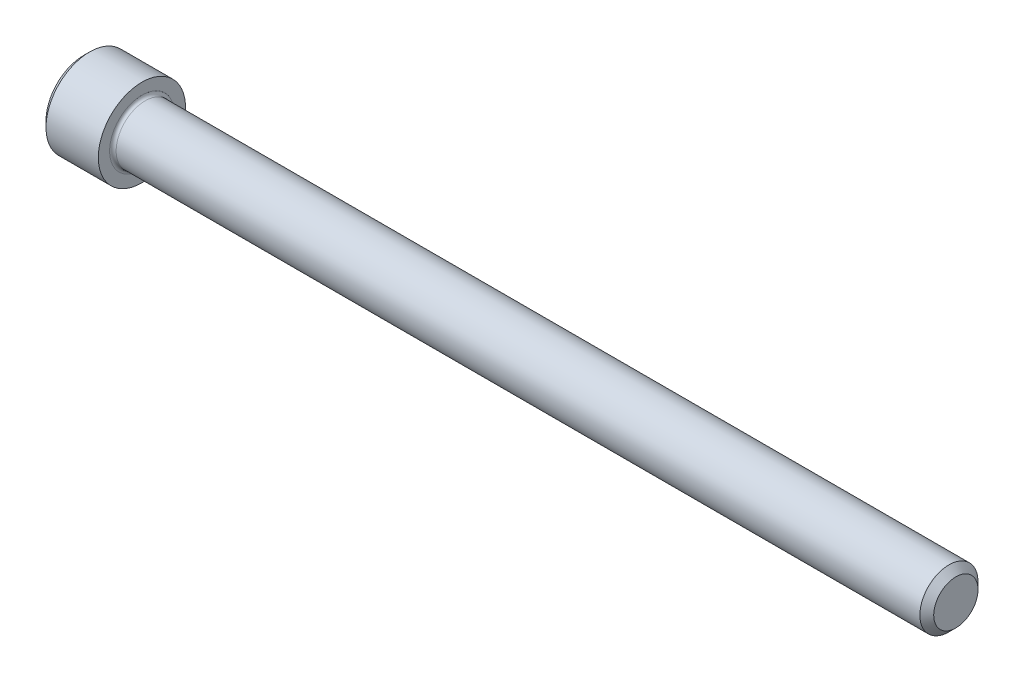
ISO-10303-21;
HEADER;
FILE_DESCRIPTION(('STEP AP214'),'2;1');
FILE_NAME('part.step','',(''),(''),'','','');
FILE_SCHEMA(('AUTOMOTIVE_DESIGN { 1 0 10303 214 1 1 1 1 }'));
ENDSEC;
DATA;
#1=APPLICATION_CONTEXT('core data for automotive mechanical design processes');
#2=APPLICATION_PROTOCOL_DEFINITION('international standard','automotive_design',2000,#1);
#3=PRODUCT_CONTEXT('',#1,'mechanical');
#4=PRODUCT('Part','Part','',(#3));
#5=PRODUCT_RELATED_PRODUCT_CATEGORY('part','',(#4));
#6=PRODUCT_DEFINITION_FORMATION('','',#4);
#7=PRODUCT_DEFINITION_CONTEXT('part definition',#1,'design');
#8=PRODUCT_DEFINITION('design','',#6,#7);
#9=PRODUCT_DEFINITION_SHAPE('','',#8);
#10=(LENGTH_UNIT() NAMED_UNIT(*) SI_UNIT(.MILLI.,.METRE.));
#11=(NAMED_UNIT(*) PLANE_ANGLE_UNIT() SI_UNIT($,.RADIAN.));
#12=(NAMED_UNIT(*) SI_UNIT($,.STERADIAN.) SOLID_ANGLE_UNIT());
#13=UNCERTAINTY_MEASURE_WITH_UNIT(LENGTH_MEASURE(1.E-05),#10,'distance_accuracy_value','');
#14=(GEOMETRIC_REPRESENTATION_CONTEXT(3) GLOBAL_UNCERTAINTY_ASSIGNED_CONTEXT((#13)) GLOBAL_UNIT_ASSIGNED_CONTEXT((#10,
#11,#12)) REPRESENTATION_CONTEXT('',''));
#15=CARTESIAN_POINT('',(0.,0.,0.));
#16=DIRECTION('',(0.,0.,1.));
#17=DIRECTION('',(1.,0.,0.));
#18=AXIS2_PLACEMENT_3D('',#15,#16,#17);
#19=CARTESIAN_POINT('',(0.,0.,0.));
#20=DIRECTION('',(-1.,0.,0.));
#21=DIRECTION('',(0.,0.,1.));
#22=AXIS2_PLACEMENT_3D('',#19,#20,#21);
#23=PLANE('',#22);
#24=DIRECTION('',(0.,-0.499999999999998,0.86602540378444));
#25=VECTOR('',#24,1.);
#26=CARTESIAN_POINT('',(0.,2.7496306570156,0.));
#27=LINE('',#26,#25);
#28=CARTESIAN_POINT('',(0.,2.7496306570156,0.));
#29=VERTEX_POINT('',#28);
#30=CARTESIAN_POINT('',(0.,1.37481532850781,2.38125));
#31=VERTEX_POINT('',#30);
#32=EDGE_CURVE('E394',#29,#31,#27,.T.);
#33=ORIENTED_EDGE('',*,*,#32,.T.);
#34=DIRECTION('',(0.,1.,0.));
#35=VECTOR('',#34,1.);
#36=CARTESIAN_POINT('',(0.,-1.37481532850779,2.38125));
#37=LINE('',#36,#35);
#38=CARTESIAN_POINT('',(0.,-1.37481532850779,2.38125));
#39=VERTEX_POINT('',#38);
#40=EDGE_CURVE('E128',#39,#31,#37,.T.);
#41=ORIENTED_EDGE('',*,*,#40,.F.);
#42=DIRECTION('',(0.,-0.500000000000001,-0.866025403784438));
#43=VECTOR('',#42,1.);
#44=CARTESIAN_POINT('',(0.,-1.37481532850779,2.38125));
#45=LINE('',#44,#43);
#46=CARTESIAN_POINT('',(0.,-2.74963065701559,0.));
#47=VERTEX_POINT('',#46);
#48=EDGE_CURVE('E397',#39,#47,#45,.T.);
#49=ORIENTED_EDGE('',*,*,#48,.T.);
#50=DIRECTION('',(0.,0.499999999999998,-0.86602540378444));
#51=VECTOR('',#50,1.);
#52=CARTESIAN_POINT('',(0.,-2.74963065701559,0.));
#53=LINE('',#52,#51);
#54=CARTESIAN_POINT('',(0.,-1.37481532850779,-2.38125));
#55=VERTEX_POINT('',#54);
#56=EDGE_CURVE('E400',#47,#55,#53,.T.);
#57=ORIENTED_EDGE('',*,*,#56,.T.);
#58=DIRECTION('',(0.,-1.,0.));
#59=VECTOR('',#58,1.);
#60=CARTESIAN_POINT('',(0.,1.3748153285078,-2.38125));
#61=LINE('',#60,#59);
#62=CARTESIAN_POINT('',(0.,1.3748153285078,-2.38125));
#63=VERTEX_POINT('',#62);
#64=EDGE_CURVE('E403',#63,#55,#61,.T.);
#65=ORIENTED_EDGE('',*,*,#64,.F.);
#66=DIRECTION('',(0.,-0.500000000000002,-0.866025403784438));
#67=VECTOR('',#66,1.);
#68=CARTESIAN_POINT('',(0.,2.7496306570156,0.));
#69=LINE('',#68,#67);
#70=EDGE_CURVE('E123',#29,#63,#69,.T.);
#71=ORIENTED_EDGE('',*,*,#70,.F.);
#72=EDGE_LOOP('',(#33,#41,#49,#57,#65,#71));
#73=FACE_BOUND('',#72,.T.);
#74=CARTESIAN_POINT('',(0.,0.,0.));
#75=DIRECTION('',(-1.,0.,0.));
#76=DIRECTION('',(0.,0.,1.));
#77=AXIS2_PLACEMENT_3D('',#74,#75,#76);
#78=CIRCLE('',#77,4.1275);
#79=CARTESIAN_POINT('',(0.,0.,4.1275));
#80=VERTEX_POINT('',#79);
#81=EDGE_CURVE('E139',#80,#80,#78,.T.);
#82=ORIENTED_EDGE('',*,*,#81,.T.);
#83=EDGE_LOOP('',(#82));
#84=FACE_BOUND('',#83,.T.);
#85=ADVANCED_FACE('F36',(#73,#84),#23,.T.);
#86=CARTESIAN_POINT('',(95.25,2.41935,0.));
#87=DIRECTION('',(1.,0.,0.));
#88=DIRECTION('',(0.,0.,-1.));
#89=AXIS2_PLACEMENT_3D('',#86,#87,#88);
#90=PLANE('',#89);
#91=CARTESIAN_POINT('',(95.25,0.,0.));
#92=DIRECTION('',(-1.,0.,0.));
#93=DIRECTION('',(0.,0.,1.));
#94=AXIS2_PLACEMENT_3D('',#91,#92,#93);
#95=CIRCLE('',#94,2.41935);
#96=CARTESIAN_POINT('',(95.25,0.,2.41935));
#97=VERTEX_POINT('',#96);
#98=EDGE_CURVE('E152',#97,#97,#95,.T.);
#99=ORIENTED_EDGE('',*,*,#98,.F.);
#100=EDGE_LOOP('',(#99));
#101=FACE_BOUND('',#100,.T.);
#102=ADVANCED_FACE('F173',(#101),#90,.T.);
#103=CARTESIAN_POINT('',(95.25,0.,0.));
#104=DIRECTION('',(-1.,0.,0.));
#105=DIRECTION('',(0.,0.,1.));
#106=AXIS2_PLACEMENT_3D('',#103,#104,#105);
#107=CONICAL_SURFACE('',#106,2.41935,0.785398163397356);
#108=CARTESIAN_POINT('',(94.4943499999999,0.,0.));
#109=DIRECTION('',(-1.,0.,0.));
#110=DIRECTION('',(0.,0.,1.));
#111=AXIS2_PLACEMENT_3D('',#108,#109,#110);
#112=CIRCLE('',#111,3.17499999999991);
#113=CARTESIAN_POINT('',(94.4943499999999,0.,3.17499999999991));
#114=VERTEX_POINT('',#113);
#115=EDGE_CURVE('E149',#114,#114,#112,.T.);
#116=ORIENTED_EDGE('',*,*,#115,.F.);
#117=EDGE_LOOP('',(#116));
#118=FACE_BOUND('',#117,.T.);
#119=ORIENTED_EDGE('',*,*,#98,.T.);
#120=EDGE_LOOP('',(#119));
#121=FACE_BOUND('',#120,.T.);
#122=ADVANCED_FACE('F179',(#118,#121),#107,.T.);
#123=CARTESIAN_POINT('',(-31.75,0.,0.));
#124=DIRECTION('',(-1.,0.,0.));
#125=DIRECTION('',(0.,0.,1.));
#126=AXIS2_PLACEMENT_3D('',#123,#124,#125);
#127=CYLINDRICAL_SURFACE('',#126,3.17499999999996);
#128=CARTESIAN_POINT('',(6.7056,0.,0.));
#129=DIRECTION('',(1.,0.,0.));
#130=DIRECTION('',(0.,0.,-1.));
#131=AXIS2_PLACEMENT_3D('',#128,#129,#130);
#132=CIRCLE('',#131,3.17499999999996);
#133=CARTESIAN_POINT('',(6.7056,0.,-3.17499999999996));
#134=VERTEX_POINT('',#133);
#135=EDGE_CURVE('E11',#134,#134,#132,.T.);
#136=ORIENTED_EDGE('',*,*,#135,.T.);
#137=EDGE_LOOP('',(#136));
#138=FACE_BOUND('',#137,.T.);
#139=ORIENTED_EDGE('',*,*,#115,.T.);
#140=EDGE_LOOP('',(#139));
#141=FACE_BOUND('',#140,.T.);
#142=ADVANCED_FACE('F190',(#138,#141),#127,.T.);
#143=CARTESIAN_POINT('',(6.35,4.7625,0.));
#144=DIRECTION('',(1.,0.,0.));
#145=DIRECTION('',(0.,0.,-1.));
#146=AXIS2_PLACEMENT_3D('',#143,#144,#145);
#147=PLANE('',#146);
#148=CARTESIAN_POINT('',(6.35,0.,0.));
#149=DIRECTION('',(1.,0.,0.));
#150=DIRECTION('',(0.,0.,-1.));
#151=AXIS2_PLACEMENT_3D('',#148,#149,#150);
#152=CIRCLE('',#151,3.53059999999996);
#153=CARTESIAN_POINT('',(6.35,0.,-3.53059999999996));
#154=VERTEX_POINT('',#153);
#155=EDGE_CURVE('E44',#154,#154,#152,.F.);
#156=ORIENTED_EDGE('',*,*,#155,.T.);
#157=EDGE_LOOP('',(#156));
#158=FACE_BOUND('',#157,.T.);
#159=CARTESIAN_POINT('',(6.35,0.,0.));
#160=DIRECTION('',(-1.,0.,0.));
#161=DIRECTION('',(0.,0.,1.));
#162=AXIS2_PLACEMENT_3D('',#159,#160,#161);
#163=CIRCLE('',#162,4.7625);
#164=CARTESIAN_POINT('',(6.35,0.,4.7625));
#165=VERTEX_POINT('',#164);
#166=EDGE_CURVE('E146',#165,#165,#163,.T.);
#167=ORIENTED_EDGE('',*,*,#166,.F.);
#168=EDGE_LOOP('',(#167));
#169=FACE_BOUND('',#168,.T.);
#170=ADVANCED_FACE('F157',(#158,#169),#147,.T.);
#171=CARTESIAN_POINT('',(-31.75,0.,0.));
#172=DIRECTION('',(-1.,0.,0.));
#173=DIRECTION('',(0.,0.,1.));
#174=AXIS2_PLACEMENT_3D('',#171,#172,#173);
#175=CYLINDRICAL_SURFACE('',#174,4.7625);
#176=ORIENTED_EDGE('',*,*,#166,.T.);
#177=EDGE_LOOP('',(#176));
#178=FACE_BOUND('',#177,.T.);
#179=CARTESIAN_POINT('',(0.635000000000004,0.,0.));
#180=DIRECTION('',(-1.,0.,0.));
#181=DIRECTION('',(0.,0.,1.));
#182=AXIS2_PLACEMENT_3D('',#179,#180,#181);
#183=CIRCLE('',#182,4.7625);
#184=CARTESIAN_POINT('',(0.635000000000004,0.,4.7625));
#185=VERTEX_POINT('',#184);
#186=EDGE_CURVE('E143',#185,#185,#183,.T.);
#187=ORIENTED_EDGE('',*,*,#186,.F.);
#188=EDGE_LOOP('',(#187));
#189=FACE_BOUND('',#188,.T.);
#190=ADVANCED_FACE('F168',(#178,#189),#175,.T.);
#191=CARTESIAN_POINT('',(0.,0.,0.));
#192=DIRECTION('',(1.,0.,0.));
#193=DIRECTION('',(0.,0.,-1.));
#194=AXIS2_PLACEMENT_3D('',#191,#192,#193);
#195=CONICAL_SURFACE('',#194,4.1275,0.785398163397447);
#196=ORIENTED_EDGE('',*,*,#186,.T.);
#197=EDGE_LOOP('',(#196));
#198=FACE_BOUND('',#197,.T.);
#199=ORIENTED_EDGE('',*,*,#81,.F.);
#200=EDGE_LOOP('',(#199));
#201=FACE_BOUND('',#200,.T.);
#202=ADVANCED_FACE('F161',(#198,#201),#195,.T.);
#203=CARTESIAN_POINT('',(6.7056,0.,0.));
#204=DIRECTION('',(1.,0.,0.));
#205=DIRECTION('',(0.,0.,-1.));
#206=AXIS2_PLACEMENT_3D('',#203,#204,#205);
#207=TOROIDAL_SURFACE('',#206,3.53059999999996,0.3556);
#208=ORIENTED_EDGE('',*,*,#135,.F.);
#209=EDGE_LOOP('',(#208));
#210=FACE_BOUND('',#209,.T.);
#211=ORIENTED_EDGE('',*,*,#155,.F.);
#212=EDGE_LOOP('',(#211));
#213=FACE_BOUND('',#212,.T.);
#214=ADVANCED_FACE('F38',(#210,#213),#207,.F.);
#215=CARTESIAN_POINT('',(3.048,2.7496306570156,0.));
#216=DIRECTION('',(0.,-0.86602540378444,-0.499999999999998));
#217=DIRECTION('',(0.,0.499999999999998,-0.86602540378444));
#218=AXIS2_PLACEMENT_3D('',#215,#216,#217);
#219=PLANE('',#218);
#220=ORIENTED_EDGE('',*,*,#32,.F.);
#221=DIRECTION('',(-1.,0.,0.));
#222=VECTOR('',#221,1.);
#223=CARTESIAN_POINT('',(3.048,2.7496306570156,0.));
#224=LINE('',#223,#222);
#225=CARTESIAN_POINT('',(3.048,2.7496306570156,0.));
#226=VERTEX_POINT('',#225);
#227=EDGE_CURVE('E393',#226,#29,#224,.T.);
#228=ORIENTED_EDGE('',*,*,#227,.F.);
#229=DIRECTION('',(0.,-0.499999999999998,0.86602540378444));
#230=VECTOR('',#229,1.);
#231=CARTESIAN_POINT('',(3.048,2.7496306570156,0.));
#232=LINE('',#231,#230);
#233=CARTESIAN_POINT('',(3.048,2.0622229927617,1.190625));
#234=VERTEX_POINT('',#233);
#235=EDGE_CURVE('E51',#226,#234,#232,.T.);
#236=ORIENTED_EDGE('',*,*,#235,.T.);
#237=CARTESIAN_POINT('',(3.048,1.37481532850781,2.38125));
#238=VERTEX_POINT('',#237);
#239=EDGE_CURVE('E109',#234,#238,#232,.T.);
#240=ORIENTED_EDGE('',*,*,#239,.T.);
#241=DIRECTION('',(-1.,0.,0.));
#242=VECTOR('',#241,1.);
#243=CARTESIAN_POINT('',(3.048,1.37481532850781,2.38125));
#244=LINE('',#243,#242);
#245=EDGE_CURVE('E121',#238,#31,#244,.T.);
#246=ORIENTED_EDGE('',*,*,#245,.T.);
#247=EDGE_LOOP('',(#220,#228,#236,#240,#246));
#248=FACE_BOUND('',#247,.T.);
#249=ADVANCED_FACE('F120',(#248),#219,.T.);
#250=CARTESIAN_POINT('',(3.048,-1.37481532850779,2.38125));
#251=DIRECTION('',(0.,0.,1.));
#252=DIRECTION('',(0.,-1.,0.));
#253=AXIS2_PLACEMENT_3D('',#250,#251,#252);
#254=PLANE('',#253);
#255=ORIENTED_EDGE('',*,*,#40,.T.);
#256=ORIENTED_EDGE('',*,*,#245,.F.);
#257=DIRECTION('',(0.,1.,0.));
#258=VECTOR('',#257,1.);
#259=CARTESIAN_POINT('',(3.048,-1.37481532850779,2.38125));
#260=LINE('',#259,#258);
#261=CARTESIAN_POINT('',(3.048,0.,2.38125));
#262=VERTEX_POINT('',#261);
#263=EDGE_CURVE('E107',#262,#238,#260,.T.);
#264=ORIENTED_EDGE('',*,*,#263,.F.);
#265=CARTESIAN_POINT('',(3.048,-1.37481532850779,2.38125));
#266=VERTEX_POINT('',#265);
#267=EDGE_CURVE('E117',#266,#262,#260,.T.);
#268=ORIENTED_EDGE('',*,*,#267,.F.);
#269=DIRECTION('',(-1.,0.,0.));
#270=VECTOR('',#269,1.);
#271=CARTESIAN_POINT('',(3.048,-1.37481532850779,2.38125));
#272=LINE('',#271,#270);
#273=EDGE_CURVE('E130',#266,#39,#272,.T.);
#274=ORIENTED_EDGE('',*,*,#273,.T.);
#275=EDGE_LOOP('',(#255,#256,#264,#268,#274));
#276=FACE_BOUND('',#275,.T.);
#277=ADVANCED_FACE('F125',(#276),#254,.F.);
#278=CARTESIAN_POINT('',(3.048,-1.37481532850779,2.38125));
#279=DIRECTION('',(0.,0.866025403784438,-0.500000000000001));
#280=DIRECTION('',(0.,0.500000000000001,0.866025403784438));
#281=AXIS2_PLACEMENT_3D('',#278,#279,#280);
#282=PLANE('',#281);
#283=ORIENTED_EDGE('',*,*,#48,.F.);
#284=ORIENTED_EDGE('',*,*,#273,.F.);
#285=DIRECTION('',(0.,-0.500000000000001,-0.866025403784438));
#286=VECTOR('',#285,1.);
#287=CARTESIAN_POINT('',(3.048,-1.37481532850779,2.38125));
#288=LINE('',#287,#286);
#289=CARTESIAN_POINT('',(3.048,-2.06222299276169,1.190625));
#290=VERTEX_POINT('',#289);
#291=EDGE_CURVE('E374',#266,#290,#288,.T.);
#292=ORIENTED_EDGE('',*,*,#291,.T.);
#293=CARTESIAN_POINT('',(3.048,-2.74963065701559,0.));
#294=VERTEX_POINT('',#293);
#295=EDGE_CURVE('E376',#290,#294,#288,.T.);
#296=ORIENTED_EDGE('',*,*,#295,.T.);
#297=DIRECTION('',(-1.,0.,0.));
#298=VECTOR('',#297,1.);
#299=CARTESIAN_POINT('',(3.048,-2.74963065701559,0.));
#300=LINE('',#299,#298);
#301=EDGE_CURVE('E135',#294,#47,#300,.T.);
#302=ORIENTED_EDGE('',*,*,#301,.T.);
#303=EDGE_LOOP('',(#283,#284,#292,#296,#302));
#304=FACE_BOUND('',#303,.T.);
#305=ADVANCED_FACE('F266',(#304),#282,.T.);
#306=CARTESIAN_POINT('',(3.048,-2.74963065701559,0.));
#307=DIRECTION('',(0.,0.86602540378444,0.499999999999998));
#308=DIRECTION('',(0.,-0.499999999999998,0.86602540378444));
#309=AXIS2_PLACEMENT_3D('',#306,#307,#308);
#310=PLANE('',#309);
#311=ORIENTED_EDGE('',*,*,#56,.F.);
#312=ORIENTED_EDGE('',*,*,#301,.F.);
#313=DIRECTION('',(0.,0.499999999999998,-0.86602540378444));
#314=VECTOR('',#313,1.);
#315=CARTESIAN_POINT('',(3.048,-2.74963065701559,0.));
#316=LINE('',#315,#314);
#317=CARTESIAN_POINT('',(3.048,-2.06222299276169,-1.19062499999999));
#318=VERTEX_POINT('',#317);
#319=EDGE_CURVE('E379',#294,#318,#316,.T.);
#320=ORIENTED_EDGE('',*,*,#319,.T.);
#321=CARTESIAN_POINT('',(3.048,-1.37481532850779,-2.38125));
#322=VERTEX_POINT('',#321);
#323=EDGE_CURVE('E383',#318,#322,#316,.T.);
#324=ORIENTED_EDGE('',*,*,#323,.T.);
#325=DIRECTION('',(-1.,0.,0.));
#326=VECTOR('',#325,1.);
#327=CARTESIAN_POINT('',(3.048,-1.37481532850779,-2.38125));
#328=LINE('',#327,#326);
#329=EDGE_CURVE('E412',#322,#55,#328,.T.);
#330=ORIENTED_EDGE('',*,*,#329,.T.);
#331=EDGE_LOOP('',(#311,#312,#320,#324,#330));
#332=FACE_BOUND('',#331,.T.);
#333=ADVANCED_FACE('F274',(#332),#310,.T.);
#334=CARTESIAN_POINT('',(3.048,1.3748153285078,-2.38125));
#335=DIRECTION('',(0.,0.,-1.));
#336=DIRECTION('',(0.,1.,0.));
#337=AXIS2_PLACEMENT_3D('',#334,#335,#336);
#338=PLANE('',#337);
#339=ORIENTED_EDGE('',*,*,#64,.T.);
#340=ORIENTED_EDGE('',*,*,#329,.F.);
#341=DIRECTION('',(0.,-1.,0.));
#342=VECTOR('',#341,1.);
#343=CARTESIAN_POINT('',(3.048,1.3748153285078,-2.38125));
#344=LINE('',#343,#342);
#345=CARTESIAN_POINT('',(3.048,0.,-2.38125));
#346=VERTEX_POINT('',#345);
#347=EDGE_CURVE('E387',#346,#322,#344,.T.);
#348=ORIENTED_EDGE('',*,*,#347,.F.);
#349=CARTESIAN_POINT('',(3.048,1.3748153285078,-2.38125));
#350=VERTEX_POINT('',#349);
#351=EDGE_CURVE('E388',#350,#346,#344,.T.);
#352=ORIENTED_EDGE('',*,*,#351,.F.);
#353=DIRECTION('',(-1.,0.,0.));
#354=VECTOR('',#353,1.);
#355=CARTESIAN_POINT('',(3.048,1.3748153285078,-2.38125));
#356=LINE('',#355,#354);
#357=EDGE_CURVE('E409',#350,#63,#356,.T.);
#358=ORIENTED_EDGE('',*,*,#357,.T.);
#359=EDGE_LOOP('',(#339,#340,#348,#352,#358));
#360=FACE_BOUND('',#359,.T.);
#361=ADVANCED_FACE('F283',(#360),#338,.F.);
#362=CARTESIAN_POINT('',(3.048,2.7496306570156,0.));
#363=DIRECTION('',(0.,0.866025403784438,-0.500000000000002));
#364=DIRECTION('',(0.,0.500000000000002,0.866025403784438));
#365=AXIS2_PLACEMENT_3D('',#362,#363,#364);
#366=PLANE('',#365);
#367=ORIENTED_EDGE('',*,*,#70,.T.);
#368=ORIENTED_EDGE('',*,*,#357,.F.);
#369=DIRECTION('',(0.,-0.500000000000002,-0.866025403784438));
#370=VECTOR('',#369,1.);
#371=CARTESIAN_POINT('',(3.048,2.7496306570156,0.));
#372=LINE('',#371,#370);
#373=CARTESIAN_POINT('',(3.048,2.0622229927617,-1.19062500000001));
#374=VERTEX_POINT('',#373);
#375=EDGE_CURVE('E391',#374,#350,#372,.T.);
#376=ORIENTED_EDGE('',*,*,#375,.F.);
#377=EDGE_CURVE('E365',#226,#374,#372,.T.);
#378=ORIENTED_EDGE('',*,*,#377,.F.);
#379=ORIENTED_EDGE('',*,*,#227,.T.);
#380=EDGE_LOOP('',(#367,#368,#376,#378,#379));
#381=FACE_BOUND('',#380,.T.);
#382=ADVANCED_FACE('F292',(#381),#366,.F.);
#383=CARTESIAN_POINT('',(3.048,1.37481532850781,2.38125));
#384=DIRECTION('',(-1.,0.,0.));
#385=DIRECTION('',(0.,0.,1.));
#386=AXIS2_PLACEMENT_3D('',#383,#384,#385);
#387=PLANE('',#386);
#388=CARTESIAN_POINT('',(3.048,0.,0.));
#389=DIRECTION('',(-1.,0.,0.));
#390=DIRECTION('',(0.,0.,1.));
#391=AXIS2_PLACEMENT_3D('',#388,#389,#390);
#392=CIRCLE('',#391,2.38125);
#393=EDGE_CURVE('E129',#290,#262,#392,.T.);
#394=ORIENTED_EDGE('',*,*,#393,.F.);
#395=ORIENTED_EDGE('',*,*,#291,.F.);
#396=ORIENTED_EDGE('',*,*,#267,.T.);
#397=EDGE_LOOP('',(#394,#395,#396));
#398=FACE_BOUND('',#397,.T.);
#399=ADVANCED_FACE('F301',(#398),#387,.T.);
#400=EDGE_CURVE('E133',#318,#290,#392,.T.);
#401=ORIENTED_EDGE('',*,*,#400,.F.);
#402=ORIENTED_EDGE('',*,*,#319,.F.);
#403=ORIENTED_EDGE('',*,*,#295,.F.);
#404=EDGE_LOOP('',(#401,#402,#403));
#405=FACE_BOUND('',#404,.T.);
#406=ADVANCED_FACE('F310',(#405),#387,.T.);
#407=EDGE_CURVE('E418',#346,#318,#392,.T.);
#408=ORIENTED_EDGE('',*,*,#407,.F.);
#409=ORIENTED_EDGE('',*,*,#347,.T.);
#410=ORIENTED_EDGE('',*,*,#323,.F.);
#411=EDGE_LOOP('',(#408,#409,#410));
#412=FACE_BOUND('',#411,.T.);
#413=ADVANCED_FACE('F319',(#412),#387,.T.);
#414=EDGE_CURVE('E368',#374,#346,#392,.T.);
#415=ORIENTED_EDGE('',*,*,#414,.F.);
#416=ORIENTED_EDGE('',*,*,#375,.T.);
#417=ORIENTED_EDGE('',*,*,#351,.T.);
#418=EDGE_LOOP('',(#415,#416,#417));
#419=FACE_BOUND('',#418,.T.);
#420=ADVANCED_FACE('F327',(#419),#387,.T.);
#421=EDGE_CURVE('E140',#234,#374,#392,.T.);
#422=ORIENTED_EDGE('',*,*,#421,.F.);
#423=ORIENTED_EDGE('',*,*,#235,.F.);
#424=ORIENTED_EDGE('',*,*,#377,.T.);
#425=EDGE_LOOP('',(#422,#423,#424));
#426=FACE_BOUND('',#425,.T.);
#427=ADVANCED_FACE('F335',(#426),#387,.T.);
#428=EDGE_CURVE('E112',#262,#234,#392,.T.);
#429=ORIENTED_EDGE('',*,*,#428,.F.);
#430=ORIENTED_EDGE('',*,*,#263,.T.);
#431=ORIENTED_EDGE('',*,*,#239,.F.);
#432=EDGE_LOOP('',(#429,#430,#431));
#433=FACE_BOUND('',#432,.T.);
#434=ADVANCED_FACE('F108',(#433),#387,.T.);
#435=CARTESIAN_POINT('',(3.048,0.,0.));
#436=DIRECTION('',(-1.,0.,0.));
#437=DIRECTION('',(0.,0.,1.));
#438=AXIS2_PLACEMENT_3D('',#435,#436,#437);
#439=CONICAL_SURFACE('',#438,2.38125,1.04719755119659);
#440=CARTESIAN_POINT('',(4.42281532850781,0.,0.));
#441=VERTEX_POINT('',#440);
#442=VERTEX_LOOP('',#441);
#443=FACE_BOUND('',#442,.T.);
#444=ORIENTED_EDGE('',*,*,#428,.T.);
#445=ORIENTED_EDGE('',*,*,#421,.T.);
#446=ORIENTED_EDGE('',*,*,#414,.T.);
#447=ORIENTED_EDGE('',*,*,#407,.T.);
#448=ORIENTED_EDGE('',*,*,#400,.T.);
#449=ORIENTED_EDGE('',*,*,#393,.T.);
#450=EDGE_LOOP('',(#444,#445,#446,#447,#448,#449));
#451=FACE_BOUND('',#450,.T.);
#452=ADVANCED_FACE('F183',(#443,#451),#439,.F.);
#453=CLOSED_SHELL('',(#85,#102,#122,#142,#170,#190,#202,#214,#249,#277,#305,#333,#361,#382,#399,
#406,#413,#420,#427,#434,#452));
#454=MANIFOLD_SOLID_BREP('B2',#453);
#455=ADVANCED_BREP_SHAPE_REPRESENTATION('',(#18,#454),#14);
#456=SHAPE_DEFINITION_REPRESENTATION(#9,#455);
ENDSEC;
END-ISO-10303-21;
